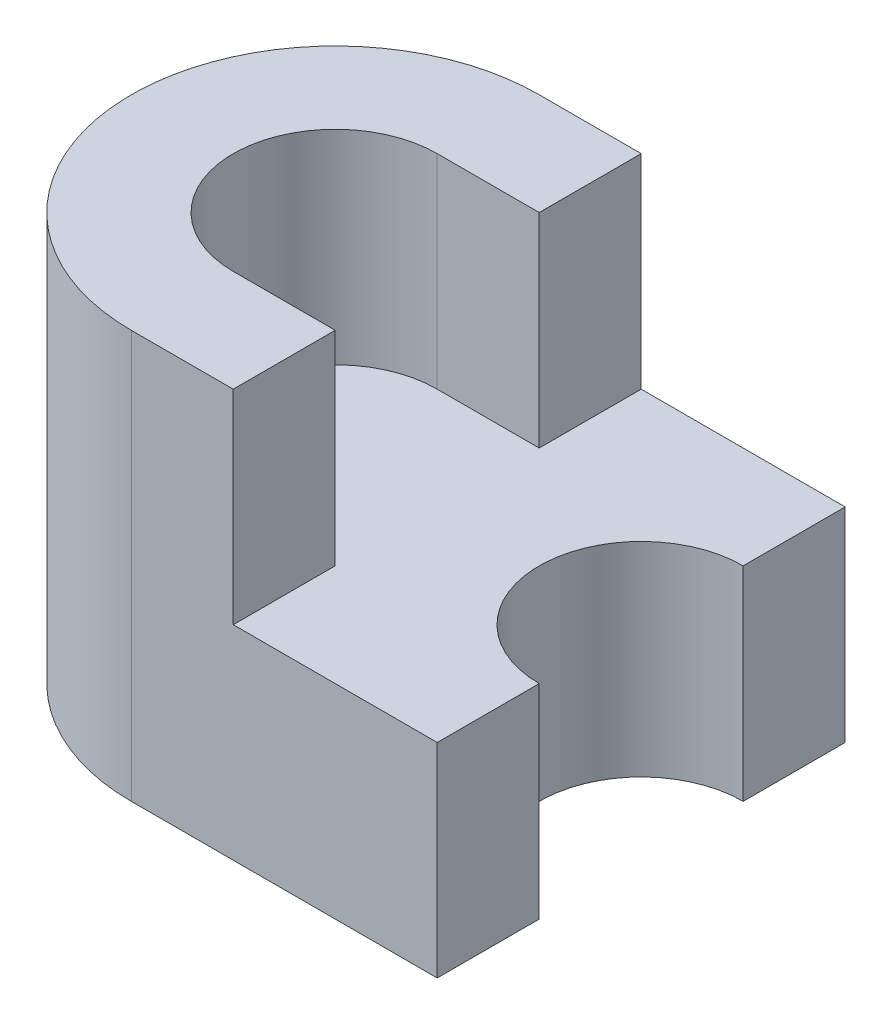
ISO-10303-21;
HEADER;
FILE_DESCRIPTION(('STEP AP214'),'2;1');
FILE_NAME('part.step','',(''),(''),'','','');
FILE_SCHEMA(('AUTOMOTIVE_DESIGN { 1 0 10303 214 1 1 1 1 }'));
ENDSEC;
DATA;
#1=APPLICATION_CONTEXT('core data for automotive mechanical design processes');
#2=APPLICATION_PROTOCOL_DEFINITION('international standard','automotive_design',2000,#1);
#3=PRODUCT_CONTEXT('',#1,'mechanical');
#4=PRODUCT('Part','Part','',(#3));
#5=PRODUCT_RELATED_PRODUCT_CATEGORY('part','',(#4));
#6=PRODUCT_DEFINITION_FORMATION('','',#4);
#7=PRODUCT_DEFINITION_CONTEXT('part definition',#1,'design');
#8=PRODUCT_DEFINITION('design','',#6,#7);
#9=PRODUCT_DEFINITION_SHAPE('','',#8);
#10=(LENGTH_UNIT() NAMED_UNIT(*) SI_UNIT(.MILLI.,.METRE.));
#11=(NAMED_UNIT(*) PLANE_ANGLE_UNIT() SI_UNIT($,.RADIAN.));
#12=(NAMED_UNIT(*) SI_UNIT($,.STERADIAN.) SOLID_ANGLE_UNIT());
#13=UNCERTAINTY_MEASURE_WITH_UNIT(LENGTH_MEASURE(1.E-05),#10,'distance_accuracy_value','');
#14=(GEOMETRIC_REPRESENTATION_CONTEXT(3) GLOBAL_UNCERTAINTY_ASSIGNED_CONTEXT((#13)) GLOBAL_UNIT_ASSIGNED_CONTEXT((#10,
#11,#12)) REPRESENTATION_CONTEXT('',''));
#15=CARTESIAN_POINT('',(0.,0.,0.));
#16=DIRECTION('',(0.,0.,1.));
#17=DIRECTION('',(1.,0.,0.));
#18=AXIS2_PLACEMENT_3D('',#15,#16,#17);
#19=CARTESIAN_POINT('',(0.845989267361107,8.29240643958333,-2.));
#20=DIRECTION('',(0.,0.,-1.));
#21=DIRECTION('',(-1.,0.,0.));
#22=AXIS2_PLACEMENT_3D('',#19,#20,#21);
#23=PLANE('',#22);
#24=DIRECTION('',(0.,-1.,0.));
#25=VECTOR('',#24,1.);
#26=CARTESIAN_POINT('',(3.84598926736111,8.29240643958333,-2.));
#27=LINE('',#26,#25);
#28=CARTESIAN_POINT('',(3.84598926736111,8.29240643958333,-2.));
#29=VERTEX_POINT('',#28);
#30=CARTESIAN_POINT('',(3.84598926736111,6.29240643958333,-2.));
#31=VERTEX_POINT('',#30);
#32=EDGE_CURVE('E197',#29,#31,#27,.T.);
#33=ORIENTED_EDGE('',*,*,#32,.T.);
#34=DIRECTION('',(1.,0.,0.));
#35=VECTOR('',#34,1.);
#36=CARTESIAN_POINT('',(0.845989267361107,6.29240643958333,-2.));
#37=LINE('',#36,#35);
#38=CARTESIAN_POINT('',(0.845989267361107,6.29240643958333,-2.));
#39=VERTEX_POINT('',#38);
#40=EDGE_CURVE('E181',#39,#31,#37,.T.);
#41=ORIENTED_EDGE('',*,*,#40,.F.);
#42=DIRECTION('',(0.,-1.,0.));
#43=VECTOR('',#42,1.);
#44=CARTESIAN_POINT('',(0.845989267361107,8.29240643958333,-2.));
#45=LINE('',#44,#43);
#46=CARTESIAN_POINT('',(0.845989267361107,10.2924064395833,-2.));
#47=VERTEX_POINT('',#46);
#48=EDGE_CURVE('E11',#47,#39,#45,.T.);
#49=ORIENTED_EDGE('',*,*,#48,.F.);
#50=DIRECTION('',(1.,0.,0.));
#51=VECTOR('',#50,1.);
#52=CARTESIAN_POINT('',(0.845989267361107,10.2924064395833,-2.));
#53=LINE('',#52,#51);
#54=CARTESIAN_POINT('',(1.84598926736111,10.2924064395833,-2.));
#55=VERTEX_POINT('',#54);
#56=EDGE_CURVE('E150',#47,#55,#53,.T.);
#57=ORIENTED_EDGE('',*,*,#56,.T.);
#58=DIRECTION('',(0.,-1.,0.));
#59=VECTOR('',#58,1.);
#60=CARTESIAN_POINT('',(1.84598926736111,10.2924064395833,-2.));
#61=LINE('',#60,#59);
#62=CARTESIAN_POINT('',(1.84598926736111,8.29240643958333,-2.));
#63=VERTEX_POINT('',#62);
#64=EDGE_CURVE('E170',#55,#63,#61,.T.);
#65=ORIENTED_EDGE('',*,*,#64,.T.);
#66=DIRECTION('',(1.,0.,0.));
#67=VECTOR('',#66,1.);
#68=CARTESIAN_POINT('',(0.845989267361107,8.29240643958333,-2.));
#69=LINE('',#68,#67);
#70=EDGE_CURVE('E182',#63,#29,#69,.T.);
#71=ORIENTED_EDGE('',*,*,#70,.T.);
#72=EDGE_LOOP('',(#33,#41,#49,#57,#65,#71));
#73=FACE_BOUND('',#72,.T.);
#74=ADVANCED_FACE('F38',(#73),#23,.T.);
#75=CARTESIAN_POINT('',(0.845989267361107,8.29240643958333,0.));
#76=DIRECTION('',(0.,-1.,0.));
#77=DIRECTION('',(0.,0.,-1.));
#78=AXIS2_PLACEMENT_3D('',#75,#76,#77);
#79=CYLINDRICAL_SURFACE('',#78,2.);
#80=CARTESIAN_POINT('',(0.845989267361107,6.29240643958333,0.));
#81=DIRECTION('',(0.,1.,0.));
#82=DIRECTION('',(0.,0.,1.));
#83=AXIS2_PLACEMENT_3D('',#80,#81,#82);
#84=CIRCLE('',#83,2.);
#85=CARTESIAN_POINT('',(0.845989267361107,6.29240643958333,2.));
#86=VERTEX_POINT('',#85);
#87=EDGE_CURVE('E199',#39,#86,#84,.T.);
#88=ORIENTED_EDGE('',*,*,#87,.T.);
#89=DIRECTION('',(0.,-1.,0.));
#90=VECTOR('',#89,1.);
#91=CARTESIAN_POINT('',(0.845989267361107,8.29240643958333,2.));
#92=LINE('',#91,#90);
#93=CARTESIAN_POINT('',(0.845989267361107,10.2924064395833,2.));
#94=VERTEX_POINT('',#93);
#95=EDGE_CURVE('E45',#94,#86,#92,.T.);
#96=ORIENTED_EDGE('',*,*,#95,.F.);
#97=CARTESIAN_POINT('',(0.845989267361107,10.2924064395833,0.));
#98=DIRECTION('',(0.,1.,0.));
#99=DIRECTION('',(0.,0.,1.));
#100=AXIS2_PLACEMENT_3D('',#97,#98,#99);
#101=CIRCLE('',#100,2.);
#102=EDGE_CURVE('E153',#47,#94,#101,.T.);
#103=ORIENTED_EDGE('',*,*,#102,.F.);
#104=ORIENTED_EDGE('',*,*,#48,.T.);
#105=EDGE_LOOP('',(#88,#96,#103,#104));
#106=FACE_BOUND('',#105,.T.);
#107=ADVANCED_FACE('F227',(#106),#79,.T.);
#108=CARTESIAN_POINT('',(0.845989267361107,8.29240643958333,2.));
#109=DIRECTION('',(0.,0.,1.));
#110=DIRECTION('',(1.,0.,0.));
#111=AXIS2_PLACEMENT_3D('',#108,#109,#110);
#112=PLANE('',#111);
#113=ORIENTED_EDGE('',*,*,#95,.T.);
#114=DIRECTION('',(-1.,0.,0.));
#115=VECTOR('',#114,1.);
#116=CARTESIAN_POINT('',(0.845989267361107,6.29240643958333,2.));
#117=LINE('',#116,#115);
#118=CARTESIAN_POINT('',(3.84598926736111,6.29240643958333,2.));
#119=VERTEX_POINT('',#118);
#120=EDGE_CURVE('E202',#119,#86,#117,.T.);
#121=ORIENTED_EDGE('',*,*,#120,.F.);
#122=DIRECTION('',(0.,-1.,0.));
#123=VECTOR('',#122,1.);
#124=CARTESIAN_POINT('',(3.84598926736111,8.29240643958333,2.));
#125=LINE('',#124,#123);
#126=CARTESIAN_POINT('',(3.84598926736111,8.29240643958333,2.));
#127=VERTEX_POINT('',#126);
#128=EDGE_CURVE('E218',#127,#119,#125,.T.);
#129=ORIENTED_EDGE('',*,*,#128,.F.);
#130=DIRECTION('',(-1.,0.,0.));
#131=VECTOR('',#130,1.);
#132=CARTESIAN_POINT('',(0.845989267361107,8.29240643958333,2.));
#133=LINE('',#132,#131);
#134=CARTESIAN_POINT('',(1.84598926736111,8.29240643958333,2.));
#135=VERTEX_POINT('',#134);
#136=EDGE_CURVE('E184',#127,#135,#133,.T.);
#137=ORIENTED_EDGE('',*,*,#136,.T.);
#138=DIRECTION('',(0.,-1.,0.));
#139=VECTOR('',#138,1.);
#140=CARTESIAN_POINT('',(1.84598926736111,10.2924064395833,2.));
#141=LINE('',#140,#139);
#142=CARTESIAN_POINT('',(1.84598926736111,10.2924064395833,2.));
#143=VERTEX_POINT('',#142);
#144=EDGE_CURVE('E167',#143,#135,#141,.T.);
#145=ORIENTED_EDGE('',*,*,#144,.F.);
#146=DIRECTION('',(-1.,0.,0.));
#147=VECTOR('',#146,1.);
#148=CARTESIAN_POINT('',(0.845989267361107,10.2924064395833,2.));
#149=LINE('',#148,#147);
#150=EDGE_CURVE('E156',#143,#94,#149,.T.);
#151=ORIENTED_EDGE('',*,*,#150,.T.);
#152=EDGE_LOOP('',(#113,#121,#129,#137,#145,#151));
#153=FACE_BOUND('',#152,.T.);
#154=ADVANCED_FACE('F222',(#153),#112,.T.);
#155=CARTESIAN_POINT('',(3.84598926736111,8.29240643958333,0.));
#156=DIRECTION('',(1.,0.,0.));
#157=DIRECTION('',(0.,0.,-1.));
#158=AXIS2_PLACEMENT_3D('',#155,#156,#157);
#159=PLANE('',#158);
#160=DIRECTION('',(0.,0.,1.));
#161=VECTOR('',#160,1.);
#162=CARTESIAN_POINT('',(3.84598926736111,6.29240643958333,0.));
#163=LINE('',#162,#161);
#164=CARTESIAN_POINT('',(3.84598926736111,6.29240643958333,1.));
#165=VERTEX_POINT('',#164);
#166=EDGE_CURVE('E204',#165,#119,#163,.T.);
#167=ORIENTED_EDGE('',*,*,#166,.F.);
#168=DIRECTION('',(0.,-1.,0.));
#169=VECTOR('',#168,1.);
#170=CARTESIAN_POINT('',(3.84598926736111,8.29240643958333,1.));
#171=LINE('',#170,#169);
#172=CARTESIAN_POINT('',(3.84598926736111,8.29240643958333,1.));
#173=VERTEX_POINT('',#172);
#174=EDGE_CURVE('E216',#173,#165,#171,.T.);
#175=ORIENTED_EDGE('',*,*,#174,.F.);
#176=DIRECTION('',(0.,0.,1.));
#177=VECTOR('',#176,1.);
#178=CARTESIAN_POINT('',(3.84598926736111,8.29240643958333,0.));
#179=LINE('',#178,#177);
#180=EDGE_CURVE('E188',#173,#127,#179,.T.);
#181=ORIENTED_EDGE('',*,*,#180,.T.);
#182=ORIENTED_EDGE('',*,*,#128,.T.);
#183=EDGE_LOOP('',(#167,#175,#181,#182));
#184=FACE_BOUND('',#183,.T.);
#185=ADVANCED_FACE('F244',(#184),#159,.T.);
#186=CARTESIAN_POINT('',(3.84598926736111,8.29240643958333,0.));
#187=DIRECTION('',(0.,-1.,0.));
#188=DIRECTION('',(0.,0.,-1.));
#189=AXIS2_PLACEMENT_3D('',#186,#187,#188);
#190=CYLINDRICAL_SURFACE('',#189,1.);
#191=CARTESIAN_POINT('',(3.84598926736111,6.29240643958333,0.));
#192=DIRECTION('',(0.,1.,0.));
#193=DIRECTION('',(0.,0.,1.));
#194=AXIS2_PLACEMENT_3D('',#191,#192,#193);
#195=CIRCLE('',#194,1.);
#196=CARTESIAN_POINT('',(3.84598926736111,6.29240643958333,-1.));
#197=VERTEX_POINT('',#196);
#198=EDGE_CURVE('E207',#197,#165,#195,.T.);
#199=ORIENTED_EDGE('',*,*,#198,.F.);
#200=DIRECTION('',(0.,-1.,0.));
#201=VECTOR('',#200,1.);
#202=CARTESIAN_POINT('',(3.84598926736111,8.29240643958333,-1.));
#203=LINE('',#202,#201);
#204=CARTESIAN_POINT('',(3.84598926736111,8.29240643958333,-1.));
#205=VERTEX_POINT('',#204);
#206=EDGE_CURVE('E214',#205,#197,#203,.T.);
#207=ORIENTED_EDGE('',*,*,#206,.F.);
#208=CARTESIAN_POINT('',(3.84598926736111,8.29240643958333,0.));
#209=DIRECTION('',(0.,1.,0.));
#210=DIRECTION('',(0.,0.,1.));
#211=AXIS2_PLACEMENT_3D('',#208,#209,#210);
#212=CIRCLE('',#211,1.);
#213=EDGE_CURVE('E191',#205,#173,#212,.T.);
#214=ORIENTED_EDGE('',*,*,#213,.T.);
#215=ORIENTED_EDGE('',*,*,#174,.T.);
#216=EDGE_LOOP('',(#199,#207,#214,#215));
#217=FACE_BOUND('',#216,.T.);
#218=ADVANCED_FACE('F240',(#217),#190,.F.);
#219=CARTESIAN_POINT('',(3.84598926736111,8.29240643958333,0.));
#220=DIRECTION('',(1.,0.,0.));
#221=DIRECTION('',(0.,0.,-1.));
#222=AXIS2_PLACEMENT_3D('',#219,#220,#221);
#223=PLANE('',#222);
#224=DIRECTION('',(0.,0.,1.));
#225=VECTOR('',#224,1.);
#226=CARTESIAN_POINT('',(3.84598926736111,6.29240643958333,0.));
#227=LINE('',#226,#225);
#228=EDGE_CURVE('E185',#31,#197,#227,.T.);
#229=ORIENTED_EDGE('',*,*,#228,.F.);
#230=ORIENTED_EDGE('',*,*,#32,.F.);
#231=DIRECTION('',(0.,0.,1.));
#232=VECTOR('',#231,1.);
#233=CARTESIAN_POINT('',(3.84598926736111,8.29240643958333,0.));
#234=LINE('',#233,#232);
#235=EDGE_CURVE('E194',#29,#205,#234,.T.);
#236=ORIENTED_EDGE('',*,*,#235,.T.);
#237=ORIENTED_EDGE('',*,*,#206,.T.);
#238=EDGE_LOOP('',(#229,#230,#236,#237));
#239=FACE_BOUND('',#238,.T.);
#240=ADVANCED_FACE('F236',(#239),#223,.T.);
#241=CARTESIAN_POINT('',(0.845989267361107,8.29240643958333,0.));
#242=DIRECTION('',(0.,1.,0.));
#243=DIRECTION('',(0.,0.,1.));
#244=AXIS2_PLACEMENT_3D('',#241,#242,#243);
#245=PLANE('',#244);
#246=DIRECTION('',(0.,0.,-1.));
#247=VECTOR('',#246,1.);
#248=CARTESIAN_POINT('',(1.84598926736111,8.29240643958333,0.));
#249=LINE('',#248,#247);
#250=CARTESIAN_POINT('',(1.84598926736111,8.29240643958333,-1.));
#251=VERTEX_POINT('',#250);
#252=EDGE_CURVE('E52',#251,#63,#249,.T.);
#253=ORIENTED_EDGE('',*,*,#252,.F.);
#254=DIRECTION('',(-1.,0.,0.));
#255=VECTOR('',#254,1.);
#256=CARTESIAN_POINT('',(0.845989267361107,8.29240643958333,-1.));
#257=LINE('',#256,#255);
#258=CARTESIAN_POINT('',(0.845989267361107,8.29240643958333,-1.));
#259=VERTEX_POINT('',#258);
#260=EDGE_CURVE('E56',#251,#259,#257,.T.);
#261=ORIENTED_EDGE('',*,*,#260,.T.);
#262=CARTESIAN_POINT('',(0.845989267361107,8.29240643958333,0.));
#263=DIRECTION('',(0.,1.,0.));
#264=DIRECTION('',(0.,0.,1.));
#265=AXIS2_PLACEMENT_3D('',#262,#263,#264);
#266=CIRCLE('',#265,1.);
#267=CARTESIAN_POINT('',(0.845989267361107,8.29240643958333,1.));
#268=VERTEX_POINT('',#267);
#269=EDGE_CURVE('E130',#268,#259,#266,.F.);
#270=ORIENTED_EDGE('',*,*,#269,.F.);
#271=DIRECTION('',(-1.,0.,0.));
#272=VECTOR('',#271,1.);
#273=CARTESIAN_POINT('',(0.845989267361107,8.29240643958333,1.));
#274=LINE('',#273,#272);
#275=CARTESIAN_POINT('',(1.84598926736111,8.29240643958333,1.));
#276=VERTEX_POINT('',#275);
#277=EDGE_CURVE('E132',#276,#268,#274,.T.);
#278=ORIENTED_EDGE('',*,*,#277,.F.);
#279=DIRECTION('',(0.,0.,1.));
#280=VECTOR('',#279,1.);
#281=CARTESIAN_POINT('',(1.84598926736111,8.29240643958333,0.));
#282=LINE('',#281,#280);
#283=EDGE_CURVE('E176',#276,#135,#282,.T.);
#284=ORIENTED_EDGE('',*,*,#283,.T.);
#285=ORIENTED_EDGE('',*,*,#136,.F.);
#286=ORIENTED_EDGE('',*,*,#180,.F.);
#287=ORIENTED_EDGE('',*,*,#213,.F.);
#288=ORIENTED_EDGE('',*,*,#235,.F.);
#289=ORIENTED_EDGE('',*,*,#70,.F.);
#290=EDGE_LOOP('',(#253,#261,#270,#278,#284,#285,#286,#287,#288,#289));
#291=FACE_BOUND('',#290,.T.);
#292=ADVANCED_FACE('F246',(#291),#245,.T.);
#293=CARTESIAN_POINT('',(0.845989267361107,6.29240643958333,0.));
#294=DIRECTION('',(0.,1.,0.));
#295=DIRECTION('',(0.,0.,1.));
#296=AXIS2_PLACEMENT_3D('',#293,#294,#295);
#297=PLANE('',#296);
#298=ORIENTED_EDGE('',*,*,#40,.T.);
#299=ORIENTED_EDGE('',*,*,#228,.T.);
#300=ORIENTED_EDGE('',*,*,#198,.T.);
#301=ORIENTED_EDGE('',*,*,#166,.T.);
#302=ORIENTED_EDGE('',*,*,#120,.T.);
#303=ORIENTED_EDGE('',*,*,#87,.F.);
#304=EDGE_LOOP('',(#298,#299,#300,#301,#302,#303));
#305=FACE_BOUND('',#304,.T.);
#306=ADVANCED_FACE('F230',(#305),#297,.F.);
#307=CARTESIAN_POINT('',(0.845989267361107,10.2924064395833,0.));
#308=DIRECTION('',(0.,-1.,0.));
#309=DIRECTION('',(0.,0.,-1.));
#310=AXIS2_PLACEMENT_3D('',#307,#308,#309);
#311=CYLINDRICAL_SURFACE('',#310,1.);
#312=DIRECTION('',(0.,-1.,0.));
#313=VECTOR('',#312,1.);
#314=CARTESIAN_POINT('',(0.845989267361107,10.2924064395833,1.));
#315=LINE('',#314,#313);
#316=CARTESIAN_POINT('',(0.845989267361107,10.2924064395833,1.));
#317=VERTEX_POINT('',#316);
#318=EDGE_CURVE('E162',#317,#268,#315,.T.);
#319=ORIENTED_EDGE('',*,*,#318,.T.);
#320=ORIENTED_EDGE('',*,*,#269,.T.);
#321=DIRECTION('',(0.,-1.,0.));
#322=VECTOR('',#321,1.);
#323=CARTESIAN_POINT('',(0.845989267361107,10.2924064395833,-1.));
#324=LINE('',#323,#322);
#325=CARTESIAN_POINT('',(0.845989267361107,10.2924064395833,-1.));
#326=VERTEX_POINT('',#325);
#327=EDGE_CURVE('E123',#326,#259,#324,.T.);
#328=ORIENTED_EDGE('',*,*,#327,.F.);
#329=CARTESIAN_POINT('',(0.845989267361107,10.2924064395833,0.));
#330=DIRECTION('',(0.,1.,0.));
#331=DIRECTION('',(0.,0.,1.));
#332=AXIS2_PLACEMENT_3D('',#329,#330,#331);
#333=CIRCLE('',#332,1.);
#334=EDGE_CURVE('E128',#326,#317,#333,.T.);
#335=ORIENTED_EDGE('',*,*,#334,.T.);
#336=EDGE_LOOP('',(#319,#320,#328,#335));
#337=FACE_BOUND('',#336,.T.);
#338=ADVANCED_FACE('F126',(#337),#311,.F.);
#339=CARTESIAN_POINT('',(0.845989267361107,10.2924064395833,-1.));
#340=DIRECTION('',(0.,0.,-1.));
#341=DIRECTION('',(-1.,0.,0.));
#342=AXIS2_PLACEMENT_3D('',#339,#340,#341);
#343=PLANE('',#342);
#344=ORIENTED_EDGE('',*,*,#260,.F.);
#345=DIRECTION('',(0.,-1.,0.));
#346=VECTOR('',#345,1.);
#347=CARTESIAN_POINT('',(1.84598926736111,10.2924064395833,-1.));
#348=LINE('',#347,#346);
#349=CARTESIAN_POINT('',(1.84598926736111,10.2924064395833,-1.));
#350=VERTEX_POINT('',#349);
#351=EDGE_CURVE('E133',#350,#251,#348,.T.);
#352=ORIENTED_EDGE('',*,*,#351,.F.);
#353=DIRECTION('',(1.,0.,0.));
#354=VECTOR('',#353,1.);
#355=CARTESIAN_POINT('',(0.845989267361107,10.2924064395833,-1.));
#356=LINE('',#355,#354);
#357=EDGE_CURVE('E136',#326,#350,#356,.T.);
#358=ORIENTED_EDGE('',*,*,#357,.F.);
#359=ORIENTED_EDGE('',*,*,#327,.T.);
#360=EDGE_LOOP('',(#344,#352,#358,#359));
#361=FACE_BOUND('',#360,.T.);
#362=ADVANCED_FACE('F137',(#361),#343,.F.);
#363=CARTESIAN_POINT('',(1.84598926736111,10.2924064395833,0.));
#364=DIRECTION('',(1.,0.,0.));
#365=DIRECTION('',(0.,0.,-1.));
#366=AXIS2_PLACEMENT_3D('',#363,#364,#365);
#367=PLANE('',#366);
#368=ORIENTED_EDGE('',*,*,#351,.T.);
#369=ORIENTED_EDGE('',*,*,#252,.T.);
#370=ORIENTED_EDGE('',*,*,#64,.F.);
#371=DIRECTION('',(0.,0.,1.));
#372=VECTOR('',#371,1.);
#373=CARTESIAN_POINT('',(1.84598926736111,10.2924064395833,0.));
#374=LINE('',#373,#372);
#375=EDGE_CURVE('E142',#55,#350,#374,.T.);
#376=ORIENTED_EDGE('',*,*,#375,.T.);
#377=EDGE_LOOP('',(#368,#369,#370,#376));
#378=FACE_BOUND('',#377,.T.);
#379=ADVANCED_FACE('F261',(#378),#367,.T.);
#380=CARTESIAN_POINT('',(1.84598926736111,10.2924064395833,0.));
#381=DIRECTION('',(-1.,0.,0.));
#382=DIRECTION('',(0.,0.,1.));
#383=AXIS2_PLACEMENT_3D('',#380,#381,#382);
#384=PLANE('',#383);
#385=ORIENTED_EDGE('',*,*,#283,.F.);
#386=DIRECTION('',(0.,-1.,0.));
#387=VECTOR('',#386,1.);
#388=CARTESIAN_POINT('',(1.84598926736111,10.2924064395833,1.));
#389=LINE('',#388,#387);
#390=CARTESIAN_POINT('',(1.84598926736111,10.2924064395833,1.));
#391=VERTEX_POINT('',#390);
#392=EDGE_CURVE('E164',#391,#276,#389,.T.);
#393=ORIENTED_EDGE('',*,*,#392,.F.);
#394=DIRECTION('',(0.,0.,-1.));
#395=VECTOR('',#394,1.);
#396=CARTESIAN_POINT('',(1.84598926736111,10.2924064395833,0.));
#397=LINE('',#396,#395);
#398=EDGE_CURVE('E159',#143,#391,#397,.T.);
#399=ORIENTED_EDGE('',*,*,#398,.F.);
#400=ORIENTED_EDGE('',*,*,#144,.T.);
#401=EDGE_LOOP('',(#385,#393,#399,#400));
#402=FACE_BOUND('',#401,.T.);
#403=ADVANCED_FACE('F250',(#402),#384,.F.);
#404=CARTESIAN_POINT('',(0.845989267361107,10.2924064395833,1.));
#405=DIRECTION('',(0.,0.,-1.));
#406=DIRECTION('',(-1.,0.,0.));
#407=AXIS2_PLACEMENT_3D('',#404,#405,#406);
#408=PLANE('',#407);
#409=ORIENTED_EDGE('',*,*,#392,.T.);
#410=ORIENTED_EDGE('',*,*,#277,.T.);
#411=ORIENTED_EDGE('',*,*,#318,.F.);
#412=DIRECTION('',(1.,0.,0.));
#413=VECTOR('',#412,1.);
#414=CARTESIAN_POINT('',(0.845989267361107,10.2924064395833,1.));
#415=LINE('',#414,#413);
#416=EDGE_CURVE('E146',#317,#391,#415,.T.);
#417=ORIENTED_EDGE('',*,*,#416,.T.);
#418=EDGE_LOOP('',(#409,#410,#411,#417));
#419=FACE_BOUND('',#418,.T.);
#420=ADVANCED_FACE('F253',(#419),#408,.T.);
#421=CARTESIAN_POINT('',(0.845989267361107,10.2924064395833,0.));
#422=DIRECTION('',(0.,1.,0.));
#423=DIRECTION('',(0.,0.,1.));
#424=AXIS2_PLACEMENT_3D('',#421,#422,#423);
#425=PLANE('',#424);
#426=ORIENTED_EDGE('',*,*,#334,.F.);
#427=ORIENTED_EDGE('',*,*,#357,.T.);
#428=ORIENTED_EDGE('',*,*,#375,.F.);
#429=ORIENTED_EDGE('',*,*,#56,.F.);
#430=ORIENTED_EDGE('',*,*,#102,.T.);
#431=ORIENTED_EDGE('',*,*,#150,.F.);
#432=ORIENTED_EDGE('',*,*,#398,.T.);
#433=ORIENTED_EDGE('',*,*,#416,.F.);
#434=EDGE_LOOP('',(#426,#427,#428,#429,#430,#431,#432,#433));
#435=FACE_BOUND('',#434,.T.);
#436=ADVANCED_FACE('F144',(#435),#425,.T.);
#437=CLOSED_SHELL('',(#74,#107,#154,#185,#218,#240,#292,#306,#338,#362,#379,#403,#420,#436));
#438=MANIFOLD_SOLID_BREP('B2',#437);
#439=ADVANCED_BREP_SHAPE_REPRESENTATION('',(#18,#438),#14);
#440=SHAPE_DEFINITION_REPRESENTATION(#9,#439);
ENDSEC;
END-ISO-10303-21;
